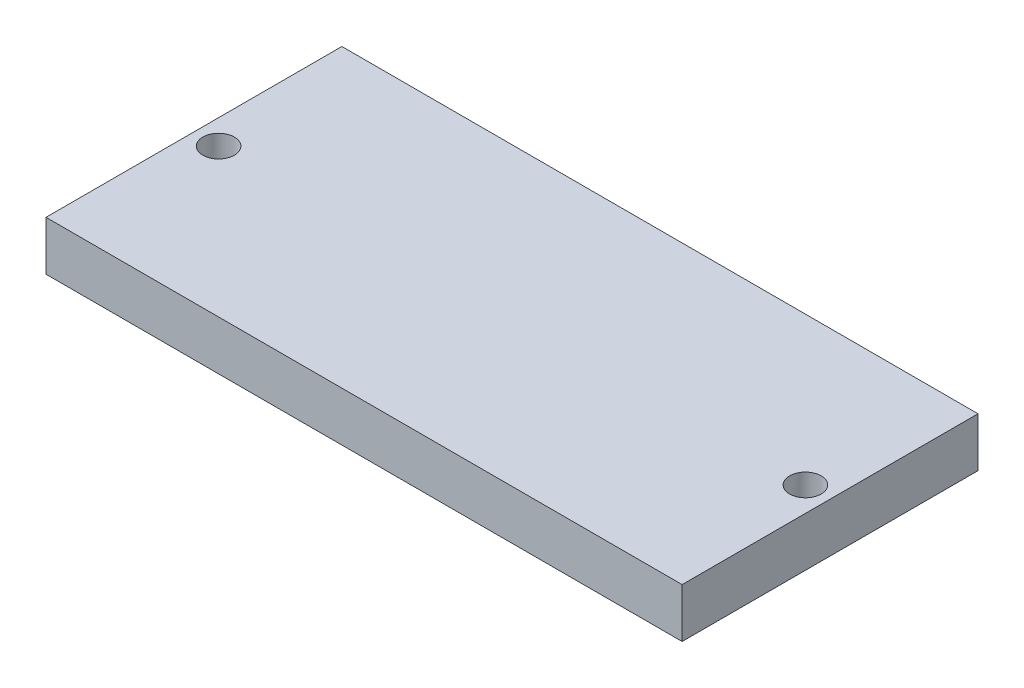
ISO-10303-21;
HEADER;
FILE_DESCRIPTION(('STEP AP214'),'2;1');
FILE_NAME('part.step','',(''),(''),'','','');
FILE_SCHEMA(('AUTOMOTIVE_DESIGN { 1 0 10303 214 1 1 1 1 }'));
ENDSEC;
DATA;
#1=APPLICATION_CONTEXT('core data for automotive mechanical design processes');
#2=APPLICATION_PROTOCOL_DEFINITION('international standard','automotive_design',2000,#1);
#3=PRODUCT_CONTEXT('',#1,'mechanical');
#4=PRODUCT('Part','Part','',(#3));
#5=PRODUCT_RELATED_PRODUCT_CATEGORY('part','',(#4));
#6=PRODUCT_DEFINITION_FORMATION('','',#4);
#7=PRODUCT_DEFINITION_CONTEXT('part definition',#1,'design');
#8=PRODUCT_DEFINITION('design','',#6,#7);
#9=PRODUCT_DEFINITION_SHAPE('','',#8);
#10=(LENGTH_UNIT() NAMED_UNIT(*) SI_UNIT(.MILLI.,.METRE.));
#11=(NAMED_UNIT(*) PLANE_ANGLE_UNIT() SI_UNIT($,.RADIAN.));
#12=(NAMED_UNIT(*) SI_UNIT($,.STERADIAN.) SOLID_ANGLE_UNIT());
#13=UNCERTAINTY_MEASURE_WITH_UNIT(LENGTH_MEASURE(1.E-05),#10,'distance_accuracy_value','');
#14=(GEOMETRIC_REPRESENTATION_CONTEXT(3) GLOBAL_UNCERTAINTY_ASSIGNED_CONTEXT((#13)) GLOBAL_UNIT_ASSIGNED_CONTEXT((#10,
#11,#12)) REPRESENTATION_CONTEXT('',''));
#15=CARTESIAN_POINT('',(0.,0.,0.));
#16=DIRECTION('',(0.,0.,1.));
#17=DIRECTION('',(1.,0.,0.));
#18=AXIS2_PLACEMENT_3D('',#15,#16,#17);
#19=CARTESIAN_POINT('',(32.25,5.,15.));
#20=DIRECTION('',(-1.,0.,0.));
#21=DIRECTION('',(0.,0.,1.));
#22=AXIS2_PLACEMENT_3D('',#19,#20,#21);
#23=PLANE('',#22);
#24=DIRECTION('',(0.,0.,-1.));
#25=VECTOR('',#24,1.);
#26=CARTESIAN_POINT('',(32.25,0.,15.));
#27=LINE('',#26,#25);
#28=CARTESIAN_POINT('',(32.25,0.,15.));
#29=VERTEX_POINT('',#28);
#30=CARTESIAN_POINT('',(32.25,0.,-15.));
#31=VERTEX_POINT('',#30);
#32=EDGE_CURVE('E111',#29,#31,#27,.T.);
#33=ORIENTED_EDGE('',*,*,#32,.T.);
#34=DIRECTION('',(0.,-1.,0.));
#35=VECTOR('',#34,1.);
#36=CARTESIAN_POINT('',(32.25,5.,-15.));
#37=LINE('',#36,#35);
#38=CARTESIAN_POINT('',(32.25,5.,-15.));
#39=VERTEX_POINT('',#38);
#40=EDGE_CURVE('E11',#39,#31,#37,.T.);
#41=ORIENTED_EDGE('',*,*,#40,.F.);
#42=DIRECTION('',(0.,0.,-1.));
#43=VECTOR('',#42,1.);
#44=CARTESIAN_POINT('',(32.25,5.,15.));
#45=LINE('',#44,#43);
#46=CARTESIAN_POINT('',(32.25,5.,15.));
#47=VERTEX_POINT('',#46);
#48=EDGE_CURVE('E95',#47,#39,#45,.T.);
#49=ORIENTED_EDGE('',*,*,#48,.F.);
#50=DIRECTION('',(0.,-1.,0.));
#51=VECTOR('',#50,1.);
#52=CARTESIAN_POINT('',(32.25,5.,15.));
#53=LINE('',#52,#51);
#54=EDGE_CURVE('E107',#47,#29,#53,.T.);
#55=ORIENTED_EDGE('',*,*,#54,.T.);
#56=EDGE_LOOP('',(#33,#41,#49,#55));
#57=FACE_BOUND('',#56,.T.);
#58=ADVANCED_FACE('F43',(#57),#23,.F.);
#59=CARTESIAN_POINT('',(-32.25,5.,-15.));
#60=DIRECTION('',(0.,0.,1.));
#61=DIRECTION('',(1.,0.,0.));
#62=AXIS2_PLACEMENT_3D('',#59,#60,#61);
#63=PLANE('',#62);
#64=DIRECTION('',(-1.,0.,0.));
#65=VECTOR('',#64,1.);
#66=CARTESIAN_POINT('',(-32.25,0.,-15.));
#67=LINE('',#66,#65);
#68=CARTESIAN_POINT('',(-32.25,0.,-15.));
#69=VERTEX_POINT('',#68);
#70=EDGE_CURVE('E100',#31,#69,#67,.T.);
#71=ORIENTED_EDGE('',*,*,#70,.T.);
#72=DIRECTION('',(0.,-1.,0.));
#73=VECTOR('',#72,1.);
#74=CARTESIAN_POINT('',(-32.25,5.,-15.));
#75=LINE('',#74,#73);
#76=CARTESIAN_POINT('',(-32.25,5.,-15.));
#77=VERTEX_POINT('',#76);
#78=EDGE_CURVE('E52',#77,#69,#75,.T.);
#79=ORIENTED_EDGE('',*,*,#78,.F.);
#80=DIRECTION('',(-1.,0.,0.));
#81=VECTOR('',#80,1.);
#82=CARTESIAN_POINT('',(-32.25,5.,-15.));
#83=LINE('',#82,#81);
#84=EDGE_CURVE('E90',#39,#77,#83,.T.);
#85=ORIENTED_EDGE('',*,*,#84,.F.);
#86=ORIENTED_EDGE('',*,*,#40,.T.);
#87=EDGE_LOOP('',(#71,#79,#85,#86));
#88=FACE_BOUND('',#87,.T.);
#89=ADVANCED_FACE('F99',(#88),#63,.F.);
#90=CARTESIAN_POINT('',(-32.25,5.,15.));
#91=DIRECTION('',(1.,0.,0.));
#92=DIRECTION('',(0.,0.,-1.));
#93=AXIS2_PLACEMENT_3D('',#90,#91,#92);
#94=PLANE('',#93);
#95=DIRECTION('',(0.,0.,1.));
#96=VECTOR('',#95,1.);
#97=CARTESIAN_POINT('',(-32.25,0.,15.));
#98=LINE('',#97,#96);
#99=CARTESIAN_POINT('',(-32.25,0.,15.));
#100=VERTEX_POINT('',#99);
#101=EDGE_CURVE('E77',#69,#100,#98,.T.);
#102=ORIENTED_EDGE('',*,*,#101,.T.);
#103=DIRECTION('',(0.,-1.,0.));
#104=VECTOR('',#103,1.);
#105=CARTESIAN_POINT('',(-32.25,5.,15.));
#106=LINE('',#105,#104);
#107=CARTESIAN_POINT('',(-32.25,5.,15.));
#108=VERTEX_POINT('',#107);
#109=EDGE_CURVE('E102',#108,#100,#106,.T.);
#110=ORIENTED_EDGE('',*,*,#109,.F.);
#111=DIRECTION('',(0.,0.,1.));
#112=VECTOR('',#111,1.);
#113=CARTESIAN_POINT('',(-32.25,5.,15.));
#114=LINE('',#113,#112);
#115=EDGE_CURVE('E93',#77,#108,#114,.T.);
#116=ORIENTED_EDGE('',*,*,#115,.F.);
#117=ORIENTED_EDGE('',*,*,#78,.T.);
#118=EDGE_LOOP('',(#102,#110,#116,#117));
#119=FACE_BOUND('',#118,.T.);
#120=ADVANCED_FACE('F103',(#119),#94,.F.);
#121=CARTESIAN_POINT('',(-32.25,5.,15.));
#122=DIRECTION('',(0.,0.,-1.));
#123=DIRECTION('',(-1.,0.,0.));
#124=AXIS2_PLACEMENT_3D('',#121,#122,#123);
#125=PLANE('',#124);
#126=DIRECTION('',(1.,0.,0.));
#127=VECTOR('',#126,1.);
#128=CARTESIAN_POINT('',(-32.25,0.,15.));
#129=LINE('',#128,#127);
#130=EDGE_CURVE('E83',#100,#29,#129,.T.);
#131=ORIENTED_EDGE('',*,*,#130,.T.);
#132=ORIENTED_EDGE('',*,*,#54,.F.);
#133=DIRECTION('',(1.,0.,0.));
#134=VECTOR('',#133,1.);
#135=CARTESIAN_POINT('',(-32.25,5.,15.));
#136=LINE('',#135,#134);
#137=EDGE_CURVE('E60',#108,#47,#136,.T.);
#138=ORIENTED_EDGE('',*,*,#137,.F.);
#139=ORIENTED_EDGE('',*,*,#109,.T.);
#140=EDGE_LOOP('',(#131,#132,#138,#139));
#141=FACE_BOUND('',#140,.T.);
#142=ADVANCED_FACE('F125',(#141),#125,.F.);
#143=CARTESIAN_POINT('',(0.,5.,0.));
#144=DIRECTION('',(0.,-1.,0.));
#145=DIRECTION('',(0.,0.,-1.));
#146=AXIS2_PLACEMENT_3D('',#143,#144,#145);
#147=PLANE('',#146);
#148=CARTESIAN_POINT('',(-29.75,5.,0.));
#149=DIRECTION('',(0.,1.,0.));
#150=DIRECTION('',(0.,0.,1.));
#151=AXIS2_PLACEMENT_3D('',#148,#149,#150);
#152=CIRCLE('',#151,1.6);
#153=CARTESIAN_POINT('',(-29.75,5.,1.59999999999999));
#154=VERTEX_POINT('',#153);
#155=EDGE_CURVE('E140',#154,#154,#152,.T.);
#156=ORIENTED_EDGE('',*,*,#155,.F.);
#157=EDGE_LOOP('',(#156));
#158=FACE_BOUND('',#157,.T.);
#159=CARTESIAN_POINT('',(29.75,5.,0.));
#160=DIRECTION('',(0.,1.,0.));
#161=DIRECTION('',(0.,0.,1.));
#162=AXIS2_PLACEMENT_3D('',#159,#160,#161);
#163=CIRCLE('',#162,1.6);
#164=CARTESIAN_POINT('',(29.75,5.,1.59999999999999));
#165=VERTEX_POINT('',#164);
#166=EDGE_CURVE('E136',#165,#165,#163,.T.);
#167=ORIENTED_EDGE('',*,*,#166,.F.);
#168=EDGE_LOOP('',(#167));
#169=FACE_BOUND('',#168,.T.);
#170=ORIENTED_EDGE('',*,*,#48,.T.);
#171=ORIENTED_EDGE('',*,*,#84,.T.);
#172=ORIENTED_EDGE('',*,*,#115,.T.);
#173=ORIENTED_EDGE('',*,*,#137,.T.);
#174=EDGE_LOOP('',(#170,#171,#172,#173));
#175=FACE_BOUND('',#174,.T.);
#176=ADVANCED_FACE('F91',(#158,#169,#175),#147,.F.);
#177=CARTESIAN_POINT('',(0.,0.,0.));
#178=DIRECTION('',(0.,-1.,0.));
#179=DIRECTION('',(0.,0.,-1.));
#180=AXIS2_PLACEMENT_3D('',#177,#178,#179);
#181=PLANE('',#180);
#182=CARTESIAN_POINT('',(-29.75,0.,0.));
#183=DIRECTION('',(0.,1.,0.));
#184=DIRECTION('',(0.,0.,1.));
#185=AXIS2_PLACEMENT_3D('',#182,#183,#184);
#186=CIRCLE('',#185,1.6);
#187=CARTESIAN_POINT('',(-29.75,0.,1.59999999999999));
#188=VERTEX_POINT('',#187);
#189=EDGE_CURVE('E115',#188,#188,#186,.T.);
#190=ORIENTED_EDGE('',*,*,#189,.T.);
#191=EDGE_LOOP('',(#190));
#192=FACE_BOUND('',#191,.T.);
#193=CARTESIAN_POINT('',(29.75,0.,0.));
#194=DIRECTION('',(0.,1.,0.));
#195=DIRECTION('',(0.,0.,1.));
#196=AXIS2_PLACEMENT_3D('',#193,#194,#195);
#197=CIRCLE('',#196,1.6);
#198=CARTESIAN_POINT('',(29.75,0.,1.59999999999999));
#199=VERTEX_POINT('',#198);
#200=EDGE_CURVE('E132',#199,#199,#197,.T.);
#201=ORIENTED_EDGE('',*,*,#200,.T.);
#202=EDGE_LOOP('',(#201));
#203=FACE_BOUND('',#202,.T.);
#204=ORIENTED_EDGE('',*,*,#32,.F.);
#205=ORIENTED_EDGE('',*,*,#130,.F.);
#206=ORIENTED_EDGE('',*,*,#101,.F.);
#207=ORIENTED_EDGE('',*,*,#70,.F.);
#208=EDGE_LOOP('',(#204,#205,#206,#207));
#209=FACE_BOUND('',#208,.T.);
#210=ADVANCED_FACE('F128',(#192,#203,#209),#181,.T.);
#211=CARTESIAN_POINT('',(29.75,0.,0.));
#212=DIRECTION('',(0.,1.,0.));
#213=DIRECTION('',(0.,0.,1.));
#214=AXIS2_PLACEMENT_3D('',#211,#212,#213);
#215=CYLINDRICAL_SURFACE('',#214,1.6);
#216=ORIENTED_EDGE('',*,*,#200,.F.);
#217=EDGE_LOOP('',(#216));
#218=FACE_BOUND('',#217,.T.);
#219=ORIENTED_EDGE('',*,*,#166,.T.);
#220=EDGE_LOOP('',(#219));
#221=FACE_BOUND('',#220,.T.);
#222=ADVANCED_FACE('F153',(#218,#221),#215,.F.);
#223=CARTESIAN_POINT('',(-29.75,0.,0.));
#224=DIRECTION('',(0.,1.,0.));
#225=DIRECTION('',(0.,0.,1.));
#226=AXIS2_PLACEMENT_3D('',#223,#224,#225);
#227=CYLINDRICAL_SURFACE('',#226,1.6);
#228=ORIENTED_EDGE('',*,*,#189,.F.);
#229=EDGE_LOOP('',(#228));
#230=FACE_BOUND('',#229,.T.);
#231=ORIENTED_EDGE('',*,*,#155,.T.);
#232=EDGE_LOOP('',(#231));
#233=FACE_BOUND('',#232,.T.);
#234=ADVANCED_FACE('F150',(#230,#233),#227,.F.);
#235=CLOSED_SHELL('',(#58,#89,#120,#142,#176,#210,#222,#234));
#236=MANIFOLD_SOLID_BREP('B2',#235);
#237=ADVANCED_BREP_SHAPE_REPRESENTATION('',(#18,#236),#14);
#238=SHAPE_DEFINITION_REPRESENTATION(#9,#237);
ENDSEC;
END-ISO-10303-21;
